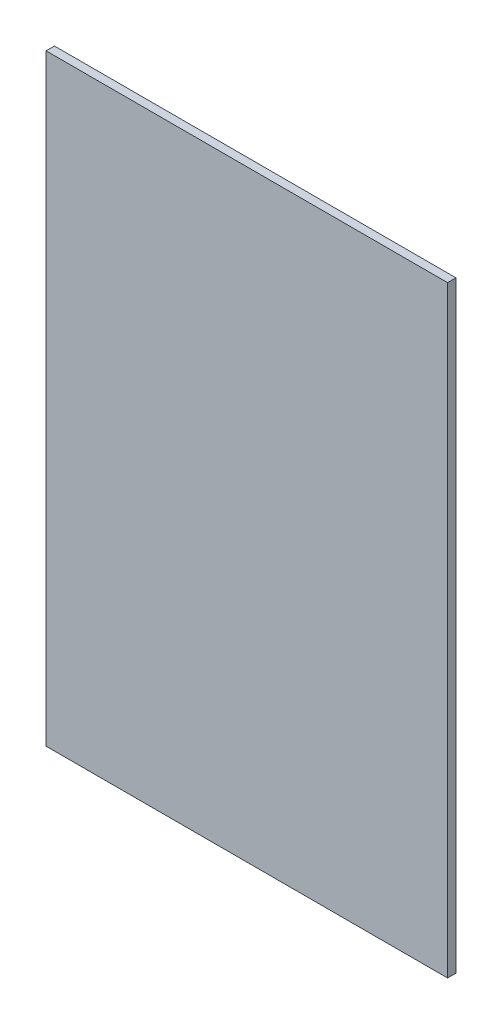
ISO-10303-21;
HEADER;
FILE_DESCRIPTION(('STEP AP214'),'2;1');
FILE_NAME('part.step','',(''),(''),'','','');
FILE_SCHEMA(('AUTOMOTIVE_DESIGN { 1 0 10303 214 1 1 1 1 }'));
ENDSEC;
DATA;
#1=APPLICATION_CONTEXT('core data for automotive mechanical design processes');
#2=APPLICATION_PROTOCOL_DEFINITION('international standard','automotive_design',2000,#1);
#3=PRODUCT_CONTEXT('',#1,'mechanical');
#4=PRODUCT('Part','Part','',(#3));
#5=PRODUCT_RELATED_PRODUCT_CATEGORY('part','',(#4));
#6=PRODUCT_DEFINITION_FORMATION('','',#4);
#7=PRODUCT_DEFINITION_CONTEXT('part definition',#1,'design');
#8=PRODUCT_DEFINITION('design','',#6,#7);
#9=PRODUCT_DEFINITION_SHAPE('','',#8);
#10=(LENGTH_UNIT() NAMED_UNIT(*) SI_UNIT(.MILLI.,.METRE.));
#11=(NAMED_UNIT(*) PLANE_ANGLE_UNIT() SI_UNIT($,.RADIAN.));
#12=(NAMED_UNIT(*) SI_UNIT($,.STERADIAN.) SOLID_ANGLE_UNIT());
#13=UNCERTAINTY_MEASURE_WITH_UNIT(LENGTH_MEASURE(1.E-05),#10,'distance_accuracy_value','');
#14=(GEOMETRIC_REPRESENTATION_CONTEXT(3) GLOBAL_UNCERTAINTY_ASSIGNED_CONTEXT((#13)) GLOBAL_UNIT_ASSIGNED_CONTEXT((#10,
#11,#12)) REPRESENTATION_CONTEXT('',''));
#15=CARTESIAN_POINT('',(0.,0.,0.));
#16=DIRECTION('',(0.,0.,1.));
#17=DIRECTION('',(1.,0.,0.));
#18=AXIS2_PLACEMENT_3D('',#15,#16,#17);
#19=CARTESIAN_POINT('',(304.8,-457.2,12.7));
#20=DIRECTION('',(-1.,0.,0.));
#21=DIRECTION('',(0.,0.,1.));
#22=AXIS2_PLACEMENT_3D('',#19,#20,#21);
#23=PLANE('',#22);
#24=DIRECTION('',(0.,1.,0.));
#25=VECTOR('',#24,1.);
#26=CARTESIAN_POINT('',(304.8,-457.2,0.));
#27=LINE('',#26,#25);
#28=CARTESIAN_POINT('',(304.8,-457.2,0.));
#29=VERTEX_POINT('',#28);
#30=CARTESIAN_POINT('',(304.8,457.2,0.));
#31=VERTEX_POINT('',#30);
#32=EDGE_CURVE('E96',#29,#31,#27,.T.);
#33=ORIENTED_EDGE('',*,*,#32,.T.);
#34=DIRECTION('',(0.,0.,-1.));
#35=VECTOR('',#34,1.);
#36=CARTESIAN_POINT('',(304.8,457.2,12.7));
#37=LINE('',#36,#35);
#38=CARTESIAN_POINT('',(304.8,457.2,12.7));
#39=VERTEX_POINT('',#38);
#40=EDGE_CURVE('E11',#39,#31,#37,.T.);
#41=ORIENTED_EDGE('',*,*,#40,.F.);
#42=DIRECTION('',(0.,1.,0.));
#43=VECTOR('',#42,1.);
#44=CARTESIAN_POINT('',(304.8,-457.2,12.7));
#45=LINE('',#44,#43);
#46=CARTESIAN_POINT('',(304.8,-457.2,12.7));
#47=VERTEX_POINT('',#46);
#48=EDGE_CURVE('E84',#47,#39,#45,.T.);
#49=ORIENTED_EDGE('',*,*,#48,.F.);
#50=DIRECTION('',(0.,0.,-1.));
#51=VECTOR('',#50,1.);
#52=CARTESIAN_POINT('',(304.8,-457.2,12.7));
#53=LINE('',#52,#51);
#54=EDGE_CURVE('E92',#47,#29,#53,.T.);
#55=ORIENTED_EDGE('',*,*,#54,.T.);
#56=EDGE_LOOP('',(#33,#41,#49,#55));
#57=FACE_BOUND('',#56,.T.);
#58=ADVANCED_FACE('F33',(#57),#23,.F.);
#59=CARTESIAN_POINT('',(-304.8,457.2,12.7));
#60=DIRECTION('',(0.,-1.,0.));
#61=DIRECTION('',(0.,0.,-1.));
#62=AXIS2_PLACEMENT_3D('',#59,#60,#61);
#63=PLANE('',#62);
#64=DIRECTION('',(-1.,0.,0.));
#65=VECTOR('',#64,1.);
#66=CARTESIAN_POINT('',(-304.8,457.2,0.));
#67=LINE('',#66,#65);
#68=CARTESIAN_POINT('',(-304.8,457.2,0.));
#69=VERTEX_POINT('',#68);
#70=EDGE_CURVE('E88',#31,#69,#67,.T.);
#71=ORIENTED_EDGE('',*,*,#70,.T.);
#72=DIRECTION('',(0.,0.,-1.));
#73=VECTOR('',#72,1.);
#74=CARTESIAN_POINT('',(-304.8,457.2,12.7));
#75=LINE('',#74,#73);
#76=CARTESIAN_POINT('',(-304.8,457.2,12.7));
#77=VERTEX_POINT('',#76);
#78=EDGE_CURVE('E41',#77,#69,#75,.T.);
#79=ORIENTED_EDGE('',*,*,#78,.F.);
#80=DIRECTION('',(-1.,0.,0.));
#81=VECTOR('',#80,1.);
#82=CARTESIAN_POINT('',(-304.8,457.2,12.7));
#83=LINE('',#82,#81);
#84=EDGE_CURVE('E79',#39,#77,#83,.T.);
#85=ORIENTED_EDGE('',*,*,#84,.F.);
#86=ORIENTED_EDGE('',*,*,#40,.T.);
#87=EDGE_LOOP('',(#71,#79,#85,#86));
#88=FACE_BOUND('',#87,.T.);
#89=ADVANCED_FACE('F87',(#88),#63,.F.);
#90=CARTESIAN_POINT('',(-304.8,-457.2,12.7));
#91=DIRECTION('',(1.,0.,0.));
#92=DIRECTION('',(0.,0.,-1.));
#93=AXIS2_PLACEMENT_3D('',#90,#91,#92);
#94=PLANE('',#93);
#95=DIRECTION('',(0.,-1.,0.));
#96=VECTOR('',#95,1.);
#97=CARTESIAN_POINT('',(-304.8,-457.2,0.));
#98=LINE('',#97,#96);
#99=CARTESIAN_POINT('',(-304.8,-457.2,0.));
#100=VERTEX_POINT('',#99);
#101=EDGE_CURVE('E66',#69,#100,#98,.T.);
#102=ORIENTED_EDGE('',*,*,#101,.T.);
#103=DIRECTION('',(0.,0.,-1.));
#104=VECTOR('',#103,1.);
#105=CARTESIAN_POINT('',(-304.8,-457.2,12.7));
#106=LINE('',#105,#104);
#107=CARTESIAN_POINT('',(-304.8,-457.2,12.7));
#108=VERTEX_POINT('',#107);
#109=EDGE_CURVE('E89',#108,#100,#106,.T.);
#110=ORIENTED_EDGE('',*,*,#109,.F.);
#111=DIRECTION('',(0.,-1.,0.));
#112=VECTOR('',#111,1.);
#113=CARTESIAN_POINT('',(-304.8,-457.2,12.7));
#114=LINE('',#113,#112);
#115=EDGE_CURVE('E82',#77,#108,#114,.T.);
#116=ORIENTED_EDGE('',*,*,#115,.F.);
#117=ORIENTED_EDGE('',*,*,#78,.T.);
#118=EDGE_LOOP('',(#102,#110,#116,#117));
#119=FACE_BOUND('',#118,.T.);
#120=ADVANCED_FACE('F90',(#119),#94,.F.);
#121=CARTESIAN_POINT('',(-304.8,-457.2,12.7));
#122=DIRECTION('',(0.,1.,0.));
#123=DIRECTION('',(0.,0.,1.));
#124=AXIS2_PLACEMENT_3D('',#121,#122,#123);
#125=PLANE('',#124);
#126=DIRECTION('',(1.,0.,0.));
#127=VECTOR('',#126,1.);
#128=CARTESIAN_POINT('',(-304.8,-457.2,0.));
#129=LINE('',#128,#127);
#130=EDGE_CURVE('E72',#100,#29,#129,.T.);
#131=ORIENTED_EDGE('',*,*,#130,.T.);
#132=ORIENTED_EDGE('',*,*,#54,.F.);
#133=DIRECTION('',(1.,0.,0.));
#134=VECTOR('',#133,1.);
#135=CARTESIAN_POINT('',(-304.8,-457.2,12.7));
#136=LINE('',#135,#134);
#137=EDGE_CURVE('E49',#108,#47,#136,.T.);
#138=ORIENTED_EDGE('',*,*,#137,.F.);
#139=ORIENTED_EDGE('',*,*,#109,.T.);
#140=EDGE_LOOP('',(#131,#132,#138,#139));
#141=FACE_BOUND('',#140,.T.);
#142=ADVANCED_FACE('F103',(#141),#125,.F.);
#143=CARTESIAN_POINT('',(0.,0.,12.7));
#144=DIRECTION('',(0.,0.,-1.));
#145=DIRECTION('',(-1.,0.,0.));
#146=AXIS2_PLACEMENT_3D('',#143,#144,#145);
#147=PLANE('',#146);
#148=ORIENTED_EDGE('',*,*,#48,.T.);
#149=ORIENTED_EDGE('',*,*,#84,.T.);
#150=ORIENTED_EDGE('',*,*,#115,.T.);
#151=ORIENTED_EDGE('',*,*,#137,.T.);
#152=EDGE_LOOP('',(#148,#149,#150,#151));
#153=FACE_BOUND('',#152,.T.);
#154=ADVANCED_FACE('F80',(#153),#147,.F.);
#155=CARTESIAN_POINT('',(0.,0.,0.));
#156=DIRECTION('',(0.,0.,-1.));
#157=DIRECTION('',(-1.,0.,0.));
#158=AXIS2_PLACEMENT_3D('',#155,#156,#157);
#159=PLANE('',#158);
#160=ORIENTED_EDGE('',*,*,#32,.F.);
#161=ORIENTED_EDGE('',*,*,#130,.F.);
#162=ORIENTED_EDGE('',*,*,#101,.F.);
#163=ORIENTED_EDGE('',*,*,#70,.F.);
#164=EDGE_LOOP('',(#160,#161,#162,#163));
#165=FACE_BOUND('',#164,.T.);
#166=ADVANCED_FACE('F106',(#165),#159,.T.);
#167=CLOSED_SHELL('',(#58,#89,#120,#142,#154,#166));
#168=MANIFOLD_SOLID_BREP('B2',#167);
#169=ADVANCED_BREP_SHAPE_REPRESENTATION('',(#18,#168),#14);
#170=SHAPE_DEFINITION_REPRESENTATION(#9,#169);
ENDSEC;
END-ISO-10303-21;
